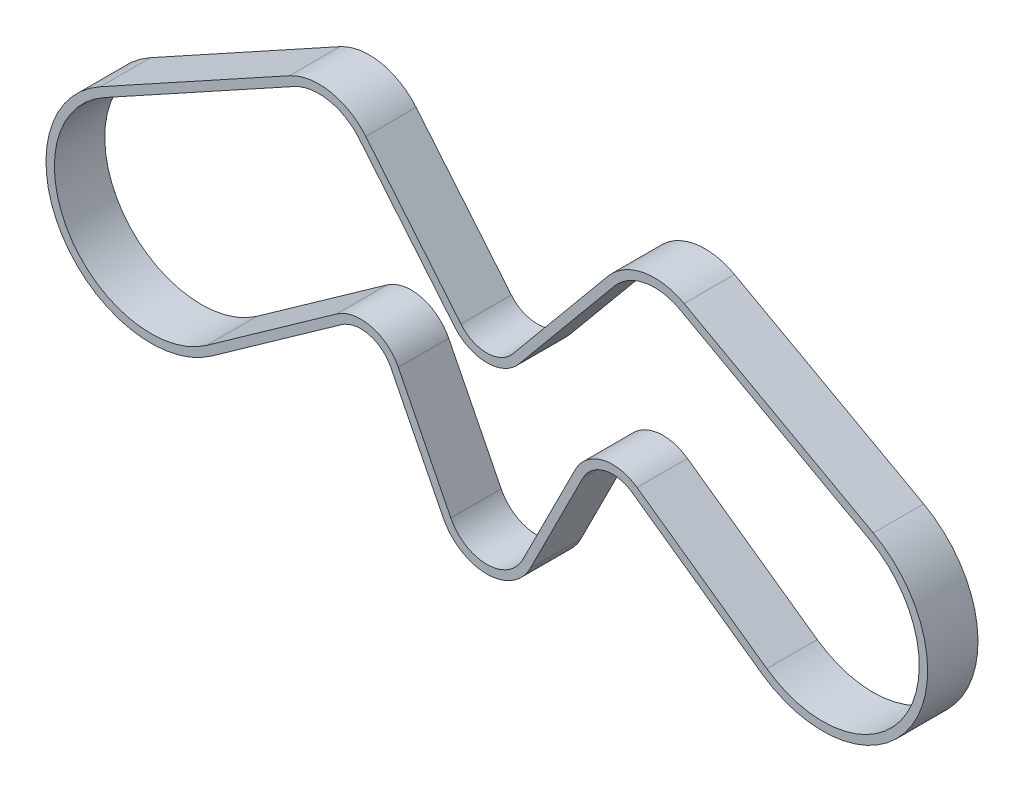
ISO-10303-21;
HEADER;
FILE_DESCRIPTION(('STEP AP214'),'2;1');
FILE_NAME('part.step','',(''),(''),'','','');
FILE_SCHEMA(('AUTOMOTIVE_DESIGN { 1 0 10303 214 1 1 1 1 }'));
ENDSEC;
DATA;
#1=APPLICATION_CONTEXT('core data for automotive mechanical design processes');
#2=APPLICATION_PROTOCOL_DEFINITION('international standard','automotive_design',2000,#1);
#3=PRODUCT_CONTEXT('',#1,'mechanical');
#4=PRODUCT('Part','Part','',(#3));
#5=PRODUCT_RELATED_PRODUCT_CATEGORY('part','',(#4));
#6=PRODUCT_DEFINITION_FORMATION('','',#4);
#7=PRODUCT_DEFINITION_CONTEXT('part definition',#1,'design');
#8=PRODUCT_DEFINITION('design','',#6,#7);
#9=PRODUCT_DEFINITION_SHAPE('','',#8);
#10=(LENGTH_UNIT() NAMED_UNIT(*) SI_UNIT(.MILLI.,.METRE.));
#11=(NAMED_UNIT(*) PLANE_ANGLE_UNIT() SI_UNIT($,.RADIAN.));
#12=(NAMED_UNIT(*) SI_UNIT($,.STERADIAN.) SOLID_ANGLE_UNIT());
#13=UNCERTAINTY_MEASURE_WITH_UNIT(LENGTH_MEASURE(1.E-05),#10,'distance_accuracy_value','');
#14=(GEOMETRIC_REPRESENTATION_CONTEXT(3) GLOBAL_UNCERTAINTY_ASSIGNED_CONTEXT((#13)) GLOBAL_UNIT_ASSIGNED_CONTEXT((#10,
#11,#12)) REPRESENTATION_CONTEXT('',''));
#15=CARTESIAN_POINT('',(0.,0.,0.));
#16=DIRECTION('',(0.,0.,1.));
#17=DIRECTION('',(1.,0.,0.));
#18=AXIS2_PLACEMENT_3D('',#15,#16,#17);
#19=CARTESIAN_POINT('',(23.4058260195633,11.784615689278,6.));
#20=DIRECTION('',(-0.893176589158385,-0.449706104672143,0.));
#21=DIRECTION('',(0.449706104672143,-0.893176589158386,0.));
#22=AXIS2_PLACEMENT_3D('',#19,#20,#21);
#23=PLANE('',#22);
#24=DIRECTION('',(-0.449706104672143,0.893176589158386,0.));
#25=VECTOR('',#24,1.);
#26=CARTESIAN_POINT('',(23.4058260195633,11.784615689278,0.));
#27=LINE('',#26,#25);
#28=CARTESIAN_POINT('',(35.7127523720349,-12.6585893024307,0.));
#29=VERTEX_POINT('',#28);
#30=CARTESIAN_POINT('',(29.4658829457859,-0.251469476644339,0.));
#31=VERTEX_POINT('',#30);
#32=EDGE_CURVE('E327',#29,#31,#27,.T.);
#33=ORIENTED_EDGE('',*,*,#32,.T.);
#34=DIRECTION('',(0.,0.,-1.));
#35=VECTOR('',#34,1.);
#36=CARTESIAN_POINT('',(29.4658829457859,-0.251469476644339,6.));
#37=LINE('',#36,#35);
#38=CARTESIAN_POINT('',(29.4658829457859,-0.251469476644339,6.));
#39=VERTEX_POINT('',#38);
#40=EDGE_CURVE('E11',#39,#31,#37,.T.);
#41=ORIENTED_EDGE('',*,*,#40,.F.);
#42=DIRECTION('',(-0.449706104672143,0.893176589158386,0.));
#43=VECTOR('',#42,1.);
#44=CARTESIAN_POINT('',(23.4058260195633,11.784615689278,6.));
#45=LINE('',#44,#43);
#46=CARTESIAN_POINT('',(35.7127523720349,-12.6585893024307,6.));
#47=VERTEX_POINT('',#46);
#48=EDGE_CURVE('E485',#47,#39,#45,.T.);
#49=ORIENTED_EDGE('',*,*,#48,.F.);
#50=DIRECTION('',(0.,0.,-1.));
#51=VECTOR('',#50,1.);
#52=CARTESIAN_POINT('',(35.7127523720349,-12.6585893024307,6.));
#53=LINE('',#52,#51);
#54=EDGE_CURVE('E358',#47,#29,#53,.T.);
#55=ORIENTED_EDGE('',*,*,#54,.T.);
#56=EDGE_LOOP('',(#33,#41,#49,#55));
#57=FACE_BOUND('',#56,.T.);
#58=ADVANCED_FACE('F35',(#57),#23,.F.);
#59=CARTESIAN_POINT('',(24.9999999999939,-2.50000000000506,6.));
#60=DIRECTION('',(0.,0.,-1.));
#61=DIRECTION('',(-1.,0.,0.));
#62=AXIS2_PLACEMENT_3D('',#59,#60,#61);
#63=CYLINDRICAL_SURFACE('',#62,5.);
#64=CARTESIAN_POINT('',(24.9999999999939,-2.50000000000506,0.));
#65=DIRECTION('',(0.,0.,1.));
#66=DIRECTION('',(1.,0.,0.));
#67=AXIS2_PLACEMENT_3D('',#64,#65,#66);
#68=CIRCLE('',#67,5.);
#69=CARTESIAN_POINT('',(22.1078672340831,1.57867234088542,0.));
#70=VERTEX_POINT('',#69);
#71=EDGE_CURVE('E330',#31,#70,#68,.T.);
#72=ORIENTED_EDGE('',*,*,#71,.T.);
#73=DIRECTION('',(0.,0.,-1.));
#74=VECTOR('',#73,1.);
#75=CARTESIAN_POINT('',(22.1078672340831,1.57867234088542,6.));
#76=LINE('',#75,#74);
#77=CARTESIAN_POINT('',(22.1078672340831,1.57867234088542,6.));
#78=VERTEX_POINT('',#77);
#79=EDGE_CURVE('E45',#78,#70,#76,.T.);
#80=ORIENTED_EDGE('',*,*,#79,.F.);
#81=CARTESIAN_POINT('',(24.9999999999939,-2.50000000000506,6.));
#82=DIRECTION('',(0.,0.,1.));
#83=DIRECTION('',(1.,0.,0.));
#84=AXIS2_PLACEMENT_3D('',#81,#82,#83);
#85=CIRCLE('',#84,5.);
#86=EDGE_CURVE('E487',#39,#78,#85,.T.);
#87=ORIENTED_EDGE('',*,*,#86,.F.);
#88=ORIENTED_EDGE('',*,*,#40,.T.);
#89=EDGE_LOOP('',(#72,#80,#87,#88));
#90=FACE_BOUND('',#89,.T.);
#91=ADVANCED_FACE('F538',(#90),#63,.T.);
#92=CARTESIAN_POINT('',(6.65190536159491,-9.38094638404809,6.));
#93=DIRECTION('',(0.578426553182166,-0.815734468178094,0.));
#94=DIRECTION('',(0.815734468178095,0.578426553182166,0.));
#95=AXIS2_PLACEMENT_3D('',#92,#93,#94);
#96=PLANE('',#95);
#97=DIRECTION('',(-0.815734468178095,-0.578426553182166,0.));
#98=VECTOR('',#97,1.);
#99=CARTESIAN_POINT('',(6.65190536159491,-9.38094638404809,0.));
#100=LINE('',#99,#98);
#101=CARTESIAN_POINT('',(6.65190536159491,-9.38094638404809,0.));
#102=VERTEX_POINT('',#101);
#103=EDGE_CURVE('E332',#70,#102,#100,.T.);
#104=ORIENTED_EDGE('',*,*,#103,.T.);
#105=DIRECTION('',(0.,0.,-1.));
#106=VECTOR('',#105,1.);
#107=CARTESIAN_POINT('',(6.65190536159491,-9.38094638404809,6.));
#108=LINE('',#107,#106);
#109=CARTESIAN_POINT('',(6.65190536159491,-9.38094638404809,6.));
#110=VERTEX_POINT('',#109);
#111=EDGE_CURVE('E389',#110,#102,#108,.T.);
#112=ORIENTED_EDGE('',*,*,#111,.F.);
#113=DIRECTION('',(-0.815734468178095,-0.578426553182166,0.));
#114=VECTOR('',#113,1.);
#115=CARTESIAN_POINT('',(6.65190536159491,-9.38094638404809,6.));
#116=LINE('',#115,#114);
#117=EDGE_CURVE('E489',#78,#110,#116,.T.);
#118=ORIENTED_EDGE('',*,*,#117,.F.);
#119=ORIENTED_EDGE('',*,*,#79,.T.);
#120=EDGE_LOOP('',(#104,#112,#118,#119));
#121=FACE_BOUND('',#120,.T.);
#122=ADVANCED_FACE('F543',(#121),#96,.F.);
#123=CARTESIAN_POINT('',(0.,0.,6.));
#124=DIRECTION('',(0.,0.,-1.));
#125=DIRECTION('',(-1.,0.,0.));
#126=AXIS2_PLACEMENT_3D('',#123,#124,#125);
#127=CYLINDRICAL_SURFACE('',#126,11.5);
#128=CARTESIAN_POINT('',(0.,0.,0.));
#129=DIRECTION('',(0.,0.,1.));
#130=DIRECTION('',(1.,0.,0.));
#131=AXIS2_PLACEMENT_3D('',#128,#129,#130);
#132=CIRCLE('',#131,11.5);
#133=CARTESIAN_POINT('',(-5.54492384116576,10.0749104013719,0.));
#134=VERTEX_POINT('',#133);
#135=EDGE_CURVE('E334',#102,#134,#132,.F.);
#136=ORIENTED_EDGE('',*,*,#135,.T.);
#137=DIRECTION('',(0.,0.,-1.));
#138=VECTOR('',#137,1.);
#139=CARTESIAN_POINT('',(-5.54492384116576,10.0749104013719,6.));
#140=LINE('',#139,#138);
#141=CARTESIAN_POINT('',(-5.54492384116576,10.0749104013719,6.));
#142=VERTEX_POINT('',#141);
#143=EDGE_CURVE('E386',#142,#134,#140,.T.);
#144=ORIENTED_EDGE('',*,*,#143,.F.);
#145=CARTESIAN_POINT('',(0.,0.,6.));
#146=DIRECTION('',(0.,0.,1.));
#147=DIRECTION('',(1.,0.,0.));
#148=AXIS2_PLACEMENT_3D('',#145,#146,#147);
#149=CIRCLE('',#148,11.5);
#150=EDGE_CURVE('E491',#110,#142,#149,.F.);
#151=ORIENTED_EDGE('',*,*,#150,.F.);
#152=ORIENTED_EDGE('',*,*,#111,.T.);
#153=EDGE_LOOP('',(#136,#144,#151,#152));
#154=FACE_BOUND('',#153,.T.);
#155=ADVANCED_FACE('F637',(#154),#127,.F.);
#156=CARTESIAN_POINT('',(-5.54492384116576,10.0749104013719,6.));
#157=DIRECTION('',(-0.482167290536153,0.876079165336686,0.));
#158=DIRECTION('',(-0.876079165336686,-0.482167290536153,0.));
#159=AXIS2_PLACEMENT_3D('',#156,#157,#158);
#160=PLANE('',#159);
#161=DIRECTION('',(0.876079165336686,0.482167290536153,0.));
#162=VECTOR('',#161,1.);
#163=CARTESIAN_POINT('',(-5.54492384116576,10.0749104013719,0.));
#164=LINE('',#163,#162);
#165=CARTESIAN_POINT('',(16.9864544341424,22.4754947833499,0.));
#166=VERTEX_POINT('',#165);
#167=EDGE_CURVE('E336',#134,#166,#164,.T.);
#168=ORIENTED_EDGE('',*,*,#167,.T.);
#169=DIRECTION('',(0.,0.,-1.));
#170=VECTOR('',#169,1.);
#171=CARTESIAN_POINT('',(16.9864544341424,22.4754947833499,6.));
#172=LINE('',#171,#170);
#173=CARTESIAN_POINT('',(16.9864544341424,22.4754947833499,6.));
#174=VERTEX_POINT('',#173);
#175=EDGE_CURVE('E383',#174,#166,#172,.T.);
#176=ORIENTED_EDGE('',*,*,#175,.F.);
#177=DIRECTION('',(0.876079165336686,0.482167290536153,0.));
#178=VECTOR('',#177,1.);
#179=CARTESIAN_POINT('',(-5.54492384116576,10.0749104013719,6.));
#180=LINE('',#179,#178);
#181=EDGE_CURVE('E493',#142,#174,#180,.T.);
#182=ORIENTED_EDGE('',*,*,#181,.F.);
#183=ORIENTED_EDGE('',*,*,#143,.T.);
#184=EDGE_LOOP('',(#168,#176,#182,#183));
#185=FACE_BOUND('',#184,.T.);
#186=ADVANCED_FACE('F633',(#185),#160,.F.);
#187=CARTESIAN_POINT('',(19.9999999999933,16.9999999999957,6.));
#188=DIRECTION('',(0.,0.,-1.));
#189=DIRECTION('',(-1.,0.,0.));
#190=AXIS2_PLACEMENT_3D('',#187,#188,#189);
#191=CYLINDRICAL_SURFACE('',#190,6.25);
#192=CARTESIAN_POINT('',(19.9999999999933,16.9999999999957,0.));
#193=DIRECTION('',(0.,0.,1.));
#194=DIRECTION('',(1.,0.,0.));
#195=AXIS2_PLACEMENT_3D('',#192,#193,#194);
#196=CIRCLE('',#195,6.25);
#197=CARTESIAN_POINT('',(24.8118906150726,20.9885095848546,0.));
#198=VERTEX_POINT('',#197);
#199=EDGE_CURVE('E338',#166,#198,#196,.F.);
#200=ORIENTED_EDGE('',*,*,#199,.T.);
#201=DIRECTION('',(0.,0.,-1.));
#202=VECTOR('',#201,1.);
#203=CARTESIAN_POINT('',(24.8118906150726,20.9885095848546,6.));
#204=LINE('',#203,#202);
#205=CARTESIAN_POINT('',(24.8118906150726,20.9885095848546,6.));
#206=VERTEX_POINT('',#205);
#207=EDGE_CURVE('E380',#206,#198,#204,.T.);
#208=ORIENTED_EDGE('',*,*,#207,.F.);
#209=CARTESIAN_POINT('',(19.9999999999933,16.9999999999957,6.));
#210=DIRECTION('',(0.,0.,1.));
#211=DIRECTION('',(1.,0.,0.));
#212=AXIS2_PLACEMENT_3D('',#209,#210,#211);
#213=CIRCLE('',#212,6.25);
#214=EDGE_CURVE('E495',#174,#206,#213,.F.);
#215=ORIENTED_EDGE('',*,*,#214,.F.);
#216=ORIENTED_EDGE('',*,*,#175,.T.);
#217=EDGE_LOOP('',(#200,#208,#215,#216));
#218=FACE_BOUND('',#217,.T.);
#219=ADVANCED_FACE('F629',(#218),#191,.F.);
#220=CARTESIAN_POINT('',(25.0193644608815,20.738205196641,6.));
#221=DIRECTION('',(0.769902498412688,0.638161533577433,0.));
#222=DIRECTION('',(-0.638161533577433,0.769902498412688,0.));
#223=AXIS2_PLACEMENT_3D('',#220,#221,#222);
#224=PLANE('',#223);
#225=DIRECTION('',(0.638161533577433,-0.769902498412688,0.));
#226=VECTOR('',#225,1.);
#227=CARTESIAN_POINT('',(25.0193644608815,20.738205196641,0.));
#228=LINE('',#227,#226);
#229=CARTESIAN_POINT('',(36.1504875079299,7.30919233210783,0.));
#230=VERTEX_POINT('',#229);
#231=EDGE_CURVE('E340',#198,#230,#228,.T.);
#232=ORIENTED_EDGE('',*,*,#231,.T.);
#233=DIRECTION('',(0.,0.,-1.));
#234=VECTOR('',#233,1.);
#235=CARTESIAN_POINT('',(36.1504875079299,7.30919233210783,6.));
#236=LINE('',#235,#234);
#237=CARTESIAN_POINT('',(36.1504875079299,7.30919233210783,6.));
#238=VERTEX_POINT('',#237);
#239=EDGE_CURVE('E377',#238,#230,#236,.T.);
#240=ORIENTED_EDGE('',*,*,#239,.F.);
#241=DIRECTION('',(0.638161533577433,-0.769902498412688,0.));
#242=VECTOR('',#241,1.);
#243=CARTESIAN_POINT('',(25.0193644608815,20.738205196641,6.));
#244=LINE('',#243,#242);
#245=EDGE_CURVE('E497',#206,#238,#244,.T.);
#246=ORIENTED_EDGE('',*,*,#245,.F.);
#247=ORIENTED_EDGE('',*,*,#207,.T.);
#248=EDGE_LOOP('',(#232,#240,#246,#247));
#249=FACE_BOUND('',#248,.T.);
#250=ADVANCED_FACE('F625',(#249),#224,.F.);
#251=CARTESIAN_POINT('',(39.9999999999933,10.499999999995,6.));
#252=DIRECTION('',(0.,0.,-1.));
#253=DIRECTION('',(-1.,0.,0.));
#254=AXIS2_PLACEMENT_3D('',#251,#252,#253);
#255=CYLINDRICAL_SURFACE('',#254,5.);
#256=CARTESIAN_POINT('',(39.9999999999933,10.499999999995,0.));
#257=DIRECTION('',(0.,0.,1.));
#258=DIRECTION('',(1.,0.,0.));
#259=AXIS2_PLACEMENT_3D('',#256,#257,#258);
#260=CIRCLE('',#259,5.);
#261=CARTESIAN_POINT('',(43.8495124920567,7.30919233210781,0.));
#262=VERTEX_POINT('',#261);
#263=EDGE_CURVE('E342',#230,#262,#260,.T.);
#264=ORIENTED_EDGE('',*,*,#263,.T.);
#265=DIRECTION('',(0.,0.,-1.));
#266=VECTOR('',#265,1.);
#267=CARTESIAN_POINT('',(43.8495124920567,7.30919233210781,6.));
#268=LINE('',#267,#266);
#269=CARTESIAN_POINT('',(43.8495124920567,7.30919233210781,6.));
#270=VERTEX_POINT('',#269);
#271=EDGE_CURVE('E374',#270,#262,#268,.T.);
#272=ORIENTED_EDGE('',*,*,#271,.F.);
#273=CARTESIAN_POINT('',(39.9999999999933,10.499999999995,6.));
#274=DIRECTION('',(0.,0.,1.));
#275=DIRECTION('',(1.,0.,0.));
#276=AXIS2_PLACEMENT_3D('',#273,#274,#275);
#277=CIRCLE('',#276,5.);
#278=EDGE_CURVE('E499',#238,#270,#277,.T.);
#279=ORIENTED_EDGE('',*,*,#278,.F.);
#280=ORIENTED_EDGE('',*,*,#239,.T.);
#281=EDGE_LOOP('',(#264,#272,#279,#280));
#282=FACE_BOUND('',#281,.T.);
#283=ADVANCED_FACE('F621',(#282),#255,.T.);
#284=CARTESIAN_POINT('',(22.4006241040783,-18.5675675307235,6.));
#285=DIRECTION('',(-0.769902498412685,0.638161533577436,0.));
#286=DIRECTION('',(-0.638161533577436,-0.769902498412685,0.));
#287=AXIS2_PLACEMENT_3D('',#284,#285,#286);
#288=PLANE('',#287);
#289=DIRECTION('',(0.638161533577436,0.769902498412685,0.));
#290=VECTOR('',#289,1.);
#291=CARTESIAN_POINT('',(22.4006241040783,-18.5675675307235,0.));
#292=LINE('',#291,#290);
#293=CARTESIAN_POINT('',(55.1881093849141,20.9885095848546,0.));
#294=VERTEX_POINT('',#293);
#295=EDGE_CURVE('E344',#262,#294,#292,.T.);
#296=ORIENTED_EDGE('',*,*,#295,.T.);
#297=DIRECTION('',(0.,0.,-1.));
#298=VECTOR('',#297,1.);
#299=CARTESIAN_POINT('',(55.1881093849141,20.9885095848546,6.));
#300=LINE('',#299,#298);
#301=CARTESIAN_POINT('',(55.1881093849141,20.9885095848546,6.));
#302=VERTEX_POINT('',#301);
#303=EDGE_CURVE('E371',#302,#294,#300,.T.);
#304=ORIENTED_EDGE('',*,*,#303,.F.);
#305=DIRECTION('',(0.638161533577436,0.769902498412685,0.));
#306=VECTOR('',#305,1.);
#307=CARTESIAN_POINT('',(22.4006241040783,-18.5675675307235,6.));
#308=LINE('',#307,#306);
#309=EDGE_CURVE('E501',#270,#302,#308,.T.);
#310=ORIENTED_EDGE('',*,*,#309,.F.);
#311=ORIENTED_EDGE('',*,*,#271,.T.);
#312=EDGE_LOOP('',(#296,#304,#310,#311));
#313=FACE_BOUND('',#312,.T.);
#314=ADVANCED_FACE('F617',(#313),#288,.F.);
#315=CARTESIAN_POINT('',(59.9999999999933,16.9999999999956,6.));
#316=DIRECTION('',(0.,0.,-1.));
#317=DIRECTION('',(-1.,0.,0.));
#318=AXIS2_PLACEMENT_3D('',#315,#316,#317);
#319=CYLINDRICAL_SURFACE('',#318,6.25);
#320=CARTESIAN_POINT('',(59.9999999999933,16.9999999999956,0.));
#321=DIRECTION('',(0.,0.,1.));
#322=DIRECTION('',(1.,0.,0.));
#323=AXIS2_PLACEMENT_3D('',#320,#321,#322);
#324=CIRCLE('',#323,6.25);
#325=CARTESIAN_POINT('',(63.0135455658397,22.4754947833525,0.));
#326=VERTEX_POINT('',#325);
#327=EDGE_CURVE('E346',#294,#326,#324,.F.);
#328=ORIENTED_EDGE('',*,*,#327,.T.);
#329=DIRECTION('',(0.,0.,-1.));
#330=VECTOR('',#329,1.);
#331=CARTESIAN_POINT('',(63.0135455658397,22.4754947833525,6.));
#332=LINE('',#331,#330);
#333=CARTESIAN_POINT('',(63.0135455658397,22.4754947833525,6.));
#334=VERTEX_POINT('',#333);
#335=EDGE_CURVE('E368',#334,#326,#332,.T.);
#336=ORIENTED_EDGE('',*,*,#335,.F.);
#337=CARTESIAN_POINT('',(59.9999999999933,16.9999999999956,6.));
#338=DIRECTION('',(0.,0.,1.));
#339=DIRECTION('',(1.,0.,0.));
#340=AXIS2_PLACEMENT_3D('',#337,#338,#339);
#341=CIRCLE('',#340,6.25);
#342=EDGE_CURVE('E503',#302,#334,#341,.F.);
#343=ORIENTED_EDGE('',*,*,#342,.F.);
#344=ORIENTED_EDGE('',*,*,#303,.T.);
#345=EDGE_LOOP('',(#328,#336,#343,#344));
#346=FACE_BOUND('',#345,.T.);
#347=ADVANCED_FACE('F613',(#346),#319,.F.);
#348=CARTESIAN_POINT('',(24.1437475261455,43.868247796999,6.));
#349=DIRECTION('',(0.482167290535413,0.876079165337094,0.));
#350=DIRECTION('',(-0.876079165337094,0.482167290535413,0.));
#351=AXIS2_PLACEMENT_3D('',#348,#349,#350);
#352=PLANE('',#351);
#353=DIRECTION('',(0.876079165337094,-0.482167290535413,0.));
#354=VECTOR('',#353,1.);
#355=CARTESIAN_POINT('',(24.1437475261455,43.868247796999,0.));
#356=LINE('',#355,#354);
#357=CARTESIAN_POINT('',(85.5449238412003,10.0749104013704,0.));
#358=VERTEX_POINT('',#357);
#359=EDGE_CURVE('E348',#326,#358,#356,.T.);
#360=ORIENTED_EDGE('',*,*,#359,.T.);
#361=DIRECTION('',(0.,0.,-1.));
#362=VECTOR('',#361,1.);
#363=CARTESIAN_POINT('',(85.5449238412003,10.0749104013704,6.));
#364=LINE('',#363,#362);
#365=CARTESIAN_POINT('',(85.5449238412003,10.0749104013704,6.));
#366=VERTEX_POINT('',#365);
#367=EDGE_CURVE('E365',#366,#358,#364,.T.);
#368=ORIENTED_EDGE('',*,*,#367,.F.);
#369=DIRECTION('',(0.876079165337094,-0.482167290535413,0.));
#370=VECTOR('',#369,1.);
#371=CARTESIAN_POINT('',(24.1437475261455,43.868247796999,6.));
#372=LINE('',#371,#370);
#373=EDGE_CURVE('E505',#334,#366,#372,.T.);
#374=ORIENTED_EDGE('',*,*,#373,.F.);
#375=ORIENTED_EDGE('',*,*,#335,.T.);
#376=EDGE_LOOP('',(#360,#368,#374,#375));
#377=FACE_BOUND('',#376,.T.);
#378=ADVANCED_FACE('F610',(#377),#352,.F.);
#379=CARTESIAN_POINT('',(80.000000000043,-6.20857532052099E-12,6.));
#380=DIRECTION('',(0.,0.,-1.));
#381=DIRECTION('',(-1.,0.,0.));
#382=AXIS2_PLACEMENT_3D('',#379,#380,#381);
#383=CYLINDRICAL_SURFACE('',#382,11.5);
#384=CARTESIAN_POINT('',(80.000000000043,-6.20857532052099E-12,0.));
#385=DIRECTION('',(0.,0.,1.));
#386=DIRECTION('',(1.,0.,0.));
#387=AXIS2_PLACEMENT_3D('',#384,#385,#386);
#388=CIRCLE('',#387,11.5);
#389=CARTESIAN_POINT('',(73.3480946384614,-9.38094638406371,0.));
#390=VERTEX_POINT('',#389);
#391=EDGE_CURVE('E350',#358,#390,#388,.F.);
#392=ORIENTED_EDGE('',*,*,#391,.T.);
#393=DIRECTION('',(0.,0.,-1.));
#394=VECTOR('',#393,1.);
#395=CARTESIAN_POINT('',(73.3480946384614,-9.38094638406371,6.));
#396=LINE('',#395,#394);
#397=CARTESIAN_POINT('',(73.3480946384614,-9.38094638406371,6.));
#398=VERTEX_POINT('',#397);
#399=EDGE_CURVE('E362',#398,#390,#396,.T.);
#400=ORIENTED_EDGE('',*,*,#399,.F.);
#401=CARTESIAN_POINT('',(80.000000000043,-6.20857532052099E-12,6.));
#402=DIRECTION('',(0.,0.,1.));
#403=DIRECTION('',(1.,0.,0.));
#404=AXIS2_PLACEMENT_3D('',#401,#402,#403);
#405=CIRCLE('',#404,11.5);
#406=EDGE_CURVE('E507',#366,#398,#405,.F.);
#407=ORIENTED_EDGE('',*,*,#406,.F.);
#408=ORIENTED_EDGE('',*,*,#367,.T.);
#409=EDGE_LOOP('',(#392,#400,#407,#408));
#410=FACE_BOUND('',#409,.T.);
#411=ADVANCED_FACE('F513',(#410),#383,.F.);
#412=CARTESIAN_POINT('',(20.1142768324191,28.3664517551326,6.));
#413=DIRECTION('',(-0.578426553181012,-0.815734468178913,0.));
#414=DIRECTION('',(0.815734468178913,-0.578426553181012,0.));
#415=AXIS2_PLACEMENT_3D('',#412,#413,#414);
#416=PLANE('',#415);
#417=DIRECTION('',(-0.815734468178913,0.578426553181012,0.));
#418=VECTOR('',#417,1.);
#419=CARTESIAN_POINT('',(20.1142768324191,28.3664517551326,0.));
#420=LINE('',#419,#418);
#421=CARTESIAN_POINT('',(57.892132765899,1.57867234088956,0.));
#422=VERTEX_POINT('',#421);
#423=EDGE_CURVE('E352',#390,#422,#420,.T.);
#424=ORIENTED_EDGE('',*,*,#423,.T.);
#425=DIRECTION('',(0.,0.,-1.));
#426=VECTOR('',#425,1.);
#427=CARTESIAN_POINT('',(57.892132765899,1.57867234088956,6.));
#428=LINE('',#427,#426);
#429=CARTESIAN_POINT('',(57.892132765899,1.57867234088956,6.));
#430=VERTEX_POINT('',#429);
#431=EDGE_CURVE('E270',#430,#422,#428,.T.);
#432=ORIENTED_EDGE('',*,*,#431,.F.);
#433=DIRECTION('',(-0.815734468178913,0.578426553181012,0.));
#434=VECTOR('',#433,1.);
#435=CARTESIAN_POINT('',(20.1142768324191,28.3664517551326,6.));
#436=LINE('',#435,#434);
#437=EDGE_CURVE('E261',#398,#430,#436,.T.);
#438=ORIENTED_EDGE('',*,*,#437,.F.);
#439=ORIENTED_EDGE('',*,*,#399,.T.);
#440=EDGE_LOOP('',(#424,#432,#438,#439));
#441=FACE_BOUND('',#440,.T.);
#442=ADVANCED_FACE('F517',(#441),#416,.F.);
#443=CARTESIAN_POINT('',(54.9999999999939,-2.500000000005,6.));
#444=DIRECTION('',(0.,0.,-1.));
#445=DIRECTION('',(-1.,0.,0.));
#446=AXIS2_PLACEMENT_3D('',#443,#444,#445);
#447=CYLINDRICAL_SURFACE('',#446,5.);
#448=CARTESIAN_POINT('',(54.9999999999939,-2.500000000005,0.));
#449=DIRECTION('',(0.,0.,1.));
#450=DIRECTION('',(1.,0.,0.));
#451=AXIS2_PLACEMENT_3D('',#448,#449,#450);
#452=CIRCLE('',#451,5.);
#453=CARTESIAN_POINT('',(50.5341170542016,-0.251469476644988,0.));
#454=VERTEX_POINT('',#453);
#455=EDGE_CURVE('E269',#422,#454,#452,.T.);
#456=ORIENTED_EDGE('',*,*,#455,.T.);
#457=DIRECTION('',(0.,0.,-1.));
#458=VECTOR('',#457,1.);
#459=CARTESIAN_POINT('',(50.5341170542016,-0.251469476644988,6.));
#460=LINE('',#459,#458);
#461=CARTESIAN_POINT('',(50.5341170542016,-0.251469476644988,6.));
#462=VERTEX_POINT('',#461);
#463=EDGE_CURVE('E266',#462,#454,#460,.T.);
#464=ORIENTED_EDGE('',*,*,#463,.F.);
#465=CARTESIAN_POINT('',(54.9999999999939,-2.500000000005,6.));
#466=DIRECTION('',(0.,0.,1.));
#467=DIRECTION('',(1.,0.,0.));
#468=AXIS2_PLACEMENT_3D('',#465,#466,#467);
#469=CIRCLE('',#468,5.);
#470=EDGE_CURVE('E255',#430,#462,#469,.T.);
#471=ORIENTED_EDGE('',*,*,#470,.F.);
#472=ORIENTED_EDGE('',*,*,#431,.T.);
#473=EDGE_LOOP('',(#456,#464,#471,#472));
#474=FACE_BOUND('',#473,.T.);
#475=ADVANCED_FACE('F267',(#474),#447,.T.);
#476=CARTESIAN_POINT('',(40.4153275340819,-20.3487414862938,6.));
#477=DIRECTION('',(0.893176589158456,-0.449706104672003,0.));
#478=DIRECTION('',(0.449706104672003,0.893176589158456,0.));
#479=AXIS2_PLACEMENT_3D('',#476,#477,#478);
#480=PLANE('',#479);
#481=DIRECTION('',(-0.449706104672003,-0.893176589158456,0.));
#482=VECTOR('',#481,1.);
#483=CARTESIAN_POINT('',(40.4153275340819,-20.3487414862938,0.));
#484=LINE('',#483,#482);
#485=CARTESIAN_POINT('',(44.2872476279557,-12.65858930243,0.));
#486=VERTEX_POINT('',#485);
#487=EDGE_CURVE('E155',#454,#486,#484,.T.);
#488=ORIENTED_EDGE('',*,*,#487,.T.);
#489=DIRECTION('',(0.,0.,-1.));
#490=VECTOR('',#489,1.);
#491=CARTESIAN_POINT('',(44.2872476279557,-12.65858930243,6.));
#492=LINE('',#491,#490);
#493=CARTESIAN_POINT('',(44.2872476279557,-12.65858930243,6.));
#494=VERTEX_POINT('',#493);
#495=EDGE_CURVE('E271',#494,#486,#492,.T.);
#496=ORIENTED_EDGE('',*,*,#495,.F.);
#497=DIRECTION('',(-0.449706104672003,-0.893176589158456,0.));
#498=VECTOR('',#497,1.);
#499=CARTESIAN_POINT('',(40.4153275340819,-20.3487414862938,6.));
#500=LINE('',#499,#498);
#501=EDGE_CURVE('E259',#462,#494,#500,.T.);
#502=ORIENTED_EDGE('',*,*,#501,.F.);
#503=ORIENTED_EDGE('',*,*,#463,.T.);
#504=EDGE_LOOP('',(#488,#496,#502,#503));
#505=FACE_BOUND('',#504,.T.);
#506=ADVANCED_FACE('F273',(#505),#480,.F.);
#507=CARTESIAN_POINT('',(0.,0.,6.));
#508=DIRECTION('',(0.,0.,-1.));
#509=DIRECTION('',(-1.,0.,0.));
#510=AXIS2_PLACEMENT_3D('',#507,#508,#509);
#511=CYLINDRICAL_SURFACE('',#510,12.5);
#512=CARTESIAN_POINT('',(0.,0.,0.));
#513=DIRECTION('',(0.,0.,1.));
#514=DIRECTION('',(1.,0.,0.));
#515=AXIS2_PLACEMENT_3D('',#512,#513,#514);
#516=CIRCLE('',#515,12.5);
#517=CARTESIAN_POINT('',(7.23033191477708,-10.1966808522262,0.));
#518=VERTEX_POINT('',#517);
#519=CARTESIAN_POINT('',(-6.02709113170192,10.9509895667086,0.));
#520=VERTEX_POINT('',#519);
#521=EDGE_CURVE('E279',#518,#520,#516,.F.);
#522=ORIENTED_EDGE('',*,*,#521,.F.);
#523=DIRECTION('',(0.,0.,-1.));
#524=VECTOR('',#523,1.);
#525=CARTESIAN_POINT('',(7.23033191477708,-10.1966808522262,6.));
#526=LINE('',#525,#524);
#527=CARTESIAN_POINT('',(7.23033191477708,-10.1966808522262,6.));
#528=VERTEX_POINT('',#527);
#529=EDGE_CURVE('E39',#528,#518,#526,.T.);
#530=ORIENTED_EDGE('',*,*,#529,.F.);
#531=CARTESIAN_POINT('',(0.,0.,6.));
#532=DIRECTION('',(0.,0.,1.));
#533=DIRECTION('',(1.,0.,0.));
#534=AXIS2_PLACEMENT_3D('',#531,#532,#533);
#535=CIRCLE('',#534,12.5);
#536=CARTESIAN_POINT('',(-6.02709113170192,10.9509895667086,6.));
#537=VERTEX_POINT('',#536);
#538=EDGE_CURVE('E357',#528,#537,#535,.F.);
#539=ORIENTED_EDGE('',*,*,#538,.T.);
#540=DIRECTION('',(0.,0.,-1.));
#541=VECTOR('',#540,1.);
#542=CARTESIAN_POINT('',(-6.02709113170192,10.9509895667086,6.));
#543=LINE('',#542,#541);
#544=EDGE_CURVE('E275',#537,#520,#543,.T.);
#545=ORIENTED_EDGE('',*,*,#544,.T.);
#546=EDGE_LOOP('',(#522,#530,#539,#545));
#547=FACE_BOUND('',#546,.T.);
#548=ADVANCED_FACE('F37',(#547),#511,.T.);
#549=CARTESIAN_POINT('',(7.23033191477708,-10.1966808522262,6.));
#550=DIRECTION('',(0.578426553182166,-0.815734468178094,0.));
#551=DIRECTION('',(0.815734468178095,0.578426553182166,0.));
#552=AXIS2_PLACEMENT_3D('',#549,#550,#551);
#553=PLANE('',#552);
#554=DIRECTION('',(-0.815734468178095,-0.578426553182166,0.));
#555=VECTOR('',#554,1.);
#556=CARTESIAN_POINT('',(7.23033191477708,-10.1966808522262,0.));
#557=LINE('',#556,#555);
#558=CARTESIAN_POINT('',(22.6862937872653,0.762937872707323,0.));
#559=VERTEX_POINT('',#558);
#560=EDGE_CURVE('E282',#559,#518,#557,.T.);
#561=ORIENTED_EDGE('',*,*,#560,.F.);
#562=DIRECTION('',(0.,0.,-1.));
#563=VECTOR('',#562,1.);
#564=CARTESIAN_POINT('',(22.6862937872653,0.762937872707323,6.));
#565=LINE('',#564,#563);
#566=CARTESIAN_POINT('',(22.6862937872653,0.762937872707323,6.));
#567=VERTEX_POINT('',#566);
#568=EDGE_CURVE('E420',#567,#559,#565,.T.);
#569=ORIENTED_EDGE('',*,*,#568,.F.);
#570=DIRECTION('',(-0.815734468178095,-0.578426553182166,0.));
#571=VECTOR('',#570,1.);
#572=CARTESIAN_POINT('',(7.23033191477708,-10.1966808522262,6.));
#573=LINE('',#572,#571);
#574=EDGE_CURVE('E429',#567,#528,#573,.T.);
#575=ORIENTED_EDGE('',*,*,#574,.T.);
#576=ORIENTED_EDGE('',*,*,#529,.T.);
#577=EDGE_LOOP('',(#561,#569,#575,#576));
#578=FACE_BOUND('',#577,.T.);
#579=ADVANCED_FACE('F427',(#578),#553,.T.);
#580=CARTESIAN_POINT('',(24.9999999999939,-2.50000000000506,6.));
#581=DIRECTION('',(0.,0.,-1.));
#582=DIRECTION('',(-1.,0.,0.));
#583=AXIS2_PLACEMENT_3D('',#580,#581,#582);
#584=CYLINDRICAL_SURFACE('',#583,4.);
#585=CARTESIAN_POINT('',(24.9999999999939,-2.50000000000506,0.));
#586=DIRECTION('',(0.,0.,1.));
#587=DIRECTION('',(1.,0.,0.));
#588=AXIS2_PLACEMENT_3D('',#585,#586,#587);
#589=CIRCLE('',#588,4.);
#590=CARTESIAN_POINT('',(28.5727063566275,-0.701175581316479,0.));
#591=VERTEX_POINT('',#590);
#592=EDGE_CURVE('E285',#591,#559,#589,.T.);
#593=ORIENTED_EDGE('',*,*,#592,.F.);
#594=DIRECTION('',(0.,0.,-1.));
#595=VECTOR('',#594,1.);
#596=CARTESIAN_POINT('',(28.5727063566275,-0.701175581316479,6.));
#597=LINE('',#596,#595);
#598=CARTESIAN_POINT('',(28.5727063566275,-0.701175581316479,6.));
#599=VERTEX_POINT('',#598);
#600=EDGE_CURVE('E419',#599,#591,#597,.T.);
#601=ORIENTED_EDGE('',*,*,#600,.F.);
#602=CARTESIAN_POINT('',(24.9999999999939,-2.50000000000506,6.));
#603=DIRECTION('',(0.,0.,1.));
#604=DIRECTION('',(1.,0.,0.));
#605=AXIS2_PLACEMENT_3D('',#602,#603,#604);
#606=CIRCLE('',#605,4.);
#607=EDGE_CURVE('E437',#599,#567,#606,.T.);
#608=ORIENTED_EDGE('',*,*,#607,.T.);
#609=ORIENTED_EDGE('',*,*,#568,.T.);
#610=EDGE_LOOP('',(#593,#601,#608,#609));
#611=FACE_BOUND('',#610,.T.);
#612=ADVANCED_FACE('F435',(#611),#584,.F.);
#613=CARTESIAN_POINT('',(22.5126494304049,11.3349095846058,6.));
#614=DIRECTION('',(-0.893176589158386,-0.449706104672143,0.));
#615=DIRECTION('',(0.449706104672143,-0.893176589158386,0.));
#616=AXIS2_PLACEMENT_3D('',#613,#614,#615);
#617=PLANE('',#616);
#618=DIRECTION('',(-0.449706104672143,0.893176589158386,0.));
#619=VECTOR('',#618,1.);
#620=CARTESIAN_POINT('',(22.5126494304049,11.3349095846058,0.));
#621=LINE('',#620,#619);
#622=CARTESIAN_POINT('',(34.8195757828765,-13.1082954071028,0.));
#623=VERTEX_POINT('',#622);
#624=EDGE_CURVE('E288',#623,#591,#621,.T.);
#625=ORIENTED_EDGE('',*,*,#624,.F.);
#626=DIRECTION('',(0.,0.,-1.));
#627=VECTOR('',#626,1.);
#628=CARTESIAN_POINT('',(34.8195757828765,-13.1082954071028,6.));
#629=LINE('',#628,#627);
#630=CARTESIAN_POINT('',(34.8195757828765,-13.1082954071028,6.));
#631=VERTEX_POINT('',#630);
#632=EDGE_CURVE('E417',#631,#623,#629,.T.);
#633=ORIENTED_EDGE('',*,*,#632,.F.);
#634=DIRECTION('',(-0.449706104672143,0.893176589158386,0.));
#635=VECTOR('',#634,1.);
#636=CARTESIAN_POINT('',(22.5126494304049,11.3349095846058,6.));
#637=LINE('',#636,#635);
#638=EDGE_CURVE('E443',#631,#599,#637,.T.);
#639=ORIENTED_EDGE('',*,*,#638,.T.);
#640=ORIENTED_EDGE('',*,*,#600,.T.);
#641=EDGE_LOOP('',(#625,#633,#639,#640));
#642=FACE_BOUND('',#641,.T.);
#643=ADVANCED_FACE('F446',(#642),#617,.T.);
#644=CARTESIAN_POINT('',(39.9999999999951,-10.5000000000044,6.));
#645=DIRECTION('',(0.,0.,-1.));
#646=DIRECTION('',(-1.,0.,0.));
#647=AXIS2_PLACEMENT_3D('',#644,#645,#646);
#648=CYLINDRICAL_SURFACE('',#647,5.8);
#649=CARTESIAN_POINT('',(39.9999999999951,-10.5000000000044,0.));
#650=DIRECTION('',(0.,0.,1.));
#651=DIRECTION('',(1.,0.,0.));
#652=AXIS2_PLACEMENT_3D('',#649,#650,#651);
#653=CIRCLE('',#652,5.8);
#654=CARTESIAN_POINT('',(45.1804242171142,-13.108295407102,0.));
#655=VERTEX_POINT('',#654);
#656=EDGE_CURVE('E291',#655,#623,#653,.F.);
#657=ORIENTED_EDGE('',*,*,#656,.F.);
#658=DIRECTION('',(0.,0.,-1.));
#659=VECTOR('',#658,1.);
#660=CARTESIAN_POINT('',(45.1804242171142,-13.108295407102,6.));
#661=LINE('',#660,#659);
#662=CARTESIAN_POINT('',(45.1804242171142,-13.108295407102,6.));
#663=VERTEX_POINT('',#662);
#664=EDGE_CURVE('E415',#663,#655,#661,.T.);
#665=ORIENTED_EDGE('',*,*,#664,.F.);
#666=CARTESIAN_POINT('',(39.9999999999951,-10.5000000000044,6.));
#667=DIRECTION('',(0.,0.,1.));
#668=DIRECTION('',(1.,0.,0.));
#669=AXIS2_PLACEMENT_3D('',#666,#667,#668);
#670=CIRCLE('',#669,5.8);
#671=EDGE_CURVE('E447',#663,#631,#670,.F.);
#672=ORIENTED_EDGE('',*,*,#671,.T.);
#673=ORIENTED_EDGE('',*,*,#632,.T.);
#674=EDGE_LOOP('',(#657,#665,#672,#673));
#675=FACE_BOUND('',#674,.T.);
#676=ADVANCED_FACE('F586',(#675),#648,.T.);
#677=CARTESIAN_POINT('',(41.3085041232404,-20.7984475909658,6.));
#678=DIRECTION('',(0.893176589158456,-0.449706104672003,0.));
#679=DIRECTION('',(0.449706104672003,0.893176589158456,0.));
#680=AXIS2_PLACEMENT_3D('',#677,#678,#679);
#681=PLANE('',#680);
#682=DIRECTION('',(-0.449706104672003,-0.893176589158456,0.));
#683=VECTOR('',#682,1.);
#684=CARTESIAN_POINT('',(41.3085041232404,-20.7984475909658,0.));
#685=LINE('',#684,#683);
#686=CARTESIAN_POINT('',(51.4272936433601,-0.701175581316989,0.));
#687=VERTEX_POINT('',#686);
#688=EDGE_CURVE('E294',#687,#655,#685,.T.);
#689=ORIENTED_EDGE('',*,*,#688,.F.);
#690=DIRECTION('',(0.,0.,-1.));
#691=VECTOR('',#690,1.);
#692=CARTESIAN_POINT('',(51.4272936433601,-0.701175581316989,6.));
#693=LINE('',#692,#691);
#694=CARTESIAN_POINT('',(51.4272936433601,-0.701175581316989,6.));
#695=VERTEX_POINT('',#694);
#696=EDGE_CURVE('E413',#695,#687,#693,.T.);
#697=ORIENTED_EDGE('',*,*,#696,.F.);
#698=DIRECTION('',(-0.449706104672003,-0.893176589158456,0.));
#699=VECTOR('',#698,1.);
#700=CARTESIAN_POINT('',(41.3085041232404,-20.7984475909658,6.));
#701=LINE('',#700,#699);
#702=EDGE_CURVE('E449',#695,#663,#701,.T.);
#703=ORIENTED_EDGE('',*,*,#702,.T.);
#704=ORIENTED_EDGE('',*,*,#664,.T.);
#705=EDGE_LOOP('',(#689,#697,#703,#704));
#706=FACE_BOUND('',#705,.T.);
#707=ADVANCED_FACE('F582',(#706),#681,.T.);
#708=CARTESIAN_POINT('',(54.9999999999939,-2.500000000005,6.));
#709=DIRECTION('',(0.,0.,-1.));
#710=DIRECTION('',(-1.,0.,0.));
#711=AXIS2_PLACEMENT_3D('',#708,#709,#710);
#712=CYLINDRICAL_SURFACE('',#711,4.);
#713=CARTESIAN_POINT('',(54.9999999999939,-2.500000000005,0.));
#714=DIRECTION('',(0.,0.,1.));
#715=DIRECTION('',(1.,0.,0.));
#716=AXIS2_PLACEMENT_3D('',#713,#714,#715);
#717=CIRCLE('',#716,4.);
#718=CARTESIAN_POINT('',(57.313706212718,0.762937872710652,0.));
#719=VERTEX_POINT('',#718);
#720=EDGE_CURVE('E297',#719,#687,#717,.T.);
#721=ORIENTED_EDGE('',*,*,#720,.F.);
#722=DIRECTION('',(0.,0.,-1.));
#723=VECTOR('',#722,1.);
#724=CARTESIAN_POINT('',(57.313706212718,0.762937872710652,6.));
#725=LINE('',#724,#723);
#726=CARTESIAN_POINT('',(57.313706212718,0.762937872710652,6.));
#727=VERTEX_POINT('',#726);
#728=EDGE_CURVE('E411',#727,#719,#725,.T.);
#729=ORIENTED_EDGE('',*,*,#728,.F.);
#730=CARTESIAN_POINT('',(54.9999999999939,-2.500000000005,6.));
#731=DIRECTION('',(0.,0.,1.));
#732=DIRECTION('',(1.,0.,0.));
#733=AXIS2_PLACEMENT_3D('',#730,#731,#732);
#734=CIRCLE('',#733,4.);
#735=EDGE_CURVE('E455',#727,#695,#734,.T.);
#736=ORIENTED_EDGE('',*,*,#735,.T.);
#737=ORIENTED_EDGE('',*,*,#696,.T.);
#738=EDGE_LOOP('',(#721,#729,#736,#737));
#739=FACE_BOUND('',#738,.T.);
#740=ADVANCED_FACE('F578',(#739),#712,.F.);
#741=CARTESIAN_POINT('',(19.5358502792381,27.5507172869537,6.));
#742=DIRECTION('',(-0.578426553181012,-0.815734468178913,0.));
#743=DIRECTION('',(0.815734468178913,-0.578426553181012,0.));
#744=AXIS2_PLACEMENT_3D('',#741,#742,#743);
#745=PLANE('',#744);
#746=DIRECTION('',(-0.815734468178913,0.578426553181012,0.));
#747=VECTOR('',#746,1.);
#748=CARTESIAN_POINT('',(19.5358502792381,27.5507172869537,0.));
#749=LINE('',#748,#747);
#750=CARTESIAN_POINT('',(72.7696680852804,-10.1966808522426,0.));
#751=VERTEX_POINT('',#750);
#752=EDGE_CURVE('E300',#751,#719,#749,.T.);
#753=ORIENTED_EDGE('',*,*,#752,.F.);
#754=DIRECTION('',(0.,0.,-1.));
#755=VECTOR('',#754,1.);
#756=CARTESIAN_POINT('',(72.7696680852804,-10.1966808522426,6.));
#757=LINE('',#756,#755);
#758=CARTESIAN_POINT('',(72.7696680852804,-10.1966808522426,6.));
#759=VERTEX_POINT('',#758);
#760=EDGE_CURVE('E409',#759,#751,#757,.T.);
#761=ORIENTED_EDGE('',*,*,#760,.F.);
#762=DIRECTION('',(-0.815734468178913,0.578426553181012,0.));
#763=VECTOR('',#762,1.);
#764=CARTESIAN_POINT('',(19.5358502792381,27.5507172869537,6.));
#765=LINE('',#764,#763);
#766=EDGE_CURVE('E458',#759,#727,#765,.T.);
#767=ORIENTED_EDGE('',*,*,#766,.T.);
#768=ORIENTED_EDGE('',*,*,#728,.T.);
#769=EDGE_LOOP('',(#753,#761,#767,#768));
#770=FACE_BOUND('',#769,.T.);
#771=ADVANCED_FACE('F574',(#770),#745,.T.);
#772=CARTESIAN_POINT('',(80.000000000043,-6.20857532052099E-12,6.));
#773=DIRECTION('',(0.,0.,-1.));
#774=DIRECTION('',(-1.,0.,0.));
#775=AXIS2_PLACEMENT_3D('',#772,#773,#774);
#776=CYLINDRICAL_SURFACE('',#775,12.5);
#777=CARTESIAN_POINT('',(80.000000000043,-6.20857532052099E-12,0.));
#778=DIRECTION('',(0.,0.,1.));
#779=DIRECTION('',(1.,0.,0.));
#780=AXIS2_PLACEMENT_3D('',#777,#778,#779);
#781=CIRCLE('',#780,12.5);
#782=CARTESIAN_POINT('',(86.0270911317357,10.9509895667075,0.));
#783=VERTEX_POINT('',#782);
#784=EDGE_CURVE('E303',#783,#751,#781,.F.);
#785=ORIENTED_EDGE('',*,*,#784,.F.);
#786=DIRECTION('',(0.,0.,-1.));
#787=VECTOR('',#786,1.);
#788=CARTESIAN_POINT('',(86.0270911317357,10.9509895667075,6.));
#789=LINE('',#788,#787);
#790=CARTESIAN_POINT('',(86.0270911317357,10.9509895667075,6.));
#791=VERTEX_POINT('',#790);
#792=EDGE_CURVE('E407',#791,#783,#789,.T.);
#793=ORIENTED_EDGE('',*,*,#792,.F.);
#794=CARTESIAN_POINT('',(80.000000000043,-6.20857532052099E-12,6.));
#795=DIRECTION('',(0.,0.,1.));
#796=DIRECTION('',(1.,0.,0.));
#797=AXIS2_PLACEMENT_3D('',#794,#795,#796);
#798=CIRCLE('',#797,12.5);
#799=EDGE_CURVE('E461',#791,#759,#798,.F.);
#800=ORIENTED_EDGE('',*,*,#799,.T.);
#801=ORIENTED_EDGE('',*,*,#760,.T.);
#802=EDGE_LOOP('',(#785,#793,#800,#801));
#803=FACE_BOUND('',#802,.T.);
#804=ADVANCED_FACE('F570',(#803),#776,.T.);
#805=CARTESIAN_POINT('',(24.625914816681,44.7443269623361,6.));
#806=DIRECTION('',(0.482167290535413,0.876079165337094,0.));
#807=DIRECTION('',(-0.876079165337094,0.482167290535413,0.));
#808=AXIS2_PLACEMENT_3D('',#805,#806,#807);
#809=PLANE('',#808);
#810=DIRECTION('',(0.876079165337094,-0.482167290535413,0.));
#811=VECTOR('',#810,1.);
#812=CARTESIAN_POINT('',(24.625914816681,44.7443269623361,0.));
#813=LINE('',#812,#811);
#814=CARTESIAN_POINT('',(63.4957128563751,23.3515739486896,0.));
#815=VERTEX_POINT('',#814);
#816=EDGE_CURVE('E306',#815,#783,#813,.T.);
#817=ORIENTED_EDGE('',*,*,#816,.F.);
#818=DIRECTION('',(0.,0.,-1.));
#819=VECTOR('',#818,1.);
#820=CARTESIAN_POINT('',(63.4957128563751,23.3515739486896,6.));
#821=LINE('',#820,#819);
#822=CARTESIAN_POINT('',(63.4957128563751,23.3515739486896,6.));
#823=VERTEX_POINT('',#822);
#824=EDGE_CURVE('E405',#823,#815,#821,.T.);
#825=ORIENTED_EDGE('',*,*,#824,.F.);
#826=DIRECTION('',(0.876079165337094,-0.482167290535413,0.));
#827=VECTOR('',#826,1.);
#828=CARTESIAN_POINT('',(24.625914816681,44.7443269623361,6.));
#829=LINE('',#828,#827);
#830=EDGE_CURVE('E464',#823,#791,#829,.T.);
#831=ORIENTED_EDGE('',*,*,#830,.T.);
#832=ORIENTED_EDGE('',*,*,#792,.T.);
#833=EDGE_LOOP('',(#817,#825,#831,#832));
#834=FACE_BOUND('',#833,.T.);
#835=ADVANCED_FACE('F566',(#834),#809,.T.);
#836=CARTESIAN_POINT('',(59.9999999999933,16.9999999999956,6.));
#837=DIRECTION('',(0.,0.,-1.));
#838=DIRECTION('',(-1.,0.,0.));
#839=AXIS2_PLACEMENT_3D('',#836,#837,#838);
#840=CYLINDRICAL_SURFACE('',#839,7.25);
#841=CARTESIAN_POINT('',(59.9999999999933,16.9999999999956,0.));
#842=DIRECTION('',(0.,0.,1.));
#843=DIRECTION('',(1.,0.,0.));
#844=AXIS2_PLACEMENT_3D('',#841,#842,#843);
#845=CIRCLE('',#844,7.25);
#846=CARTESIAN_POINT('',(54.4182068865014,21.626671118432,0.));
#847=VERTEX_POINT('',#846);
#848=EDGE_CURVE('E309',#847,#815,#845,.F.);
#849=ORIENTED_EDGE('',*,*,#848,.F.);
#850=DIRECTION('',(0.,0.,-1.));
#851=VECTOR('',#850,1.);
#852=CARTESIAN_POINT('',(54.4182068865014,21.626671118432,6.));
#853=LINE('',#852,#851);
#854=CARTESIAN_POINT('',(54.4182068865014,21.626671118432,6.));
#855=VERTEX_POINT('',#854);
#856=EDGE_CURVE('E403',#855,#847,#853,.T.);
#857=ORIENTED_EDGE('',*,*,#856,.F.);
#858=CARTESIAN_POINT('',(59.9999999999933,16.9999999999956,6.));
#859=DIRECTION('',(0.,0.,1.));
#860=DIRECTION('',(1.,0.,0.));
#861=AXIS2_PLACEMENT_3D('',#858,#859,#860);
#862=CIRCLE('',#861,7.25);
#863=EDGE_CURVE('E467',#855,#823,#862,.F.);
#864=ORIENTED_EDGE('',*,*,#863,.T.);
#865=ORIENTED_EDGE('',*,*,#824,.T.);
#866=EDGE_LOOP('',(#849,#857,#864,#865));
#867=FACE_BOUND('',#866,.T.);
#868=ADVANCED_FACE('F562',(#867),#840,.T.);
#869=CARTESIAN_POINT('',(21.6307216056656,-17.929405997146,6.));
#870=DIRECTION('',(-0.769902498412685,0.638161533577436,0.));
#871=DIRECTION('',(-0.638161533577436,-0.769902498412685,0.));
#872=AXIS2_PLACEMENT_3D('',#869,#870,#871);
#873=PLANE('',#872);
#874=DIRECTION('',(0.638161533577436,0.769902498412685,0.));
#875=VECTOR('',#874,1.);
#876=CARTESIAN_POINT('',(21.6307216056656,-17.929405997146,0.));
#877=LINE('',#876,#875);
#878=CARTESIAN_POINT('',(43.079609993644,7.94735386568525,0.));
#879=VERTEX_POINT('',#878);
#880=EDGE_CURVE('E312',#879,#847,#877,.T.);
#881=ORIENTED_EDGE('',*,*,#880,.F.);
#882=DIRECTION('',(0.,0.,-1.));
#883=VECTOR('',#882,1.);
#884=CARTESIAN_POINT('',(43.079609993644,7.94735386568525,6.));
#885=LINE('',#884,#883);
#886=CARTESIAN_POINT('',(43.079609993644,7.94735386568525,6.));
#887=VERTEX_POINT('',#886);
#888=EDGE_CURVE('E401',#887,#879,#885,.T.);
#889=ORIENTED_EDGE('',*,*,#888,.F.);
#890=DIRECTION('',(0.638161533577436,0.769902498412685,0.));
#891=VECTOR('',#890,1.);
#892=CARTESIAN_POINT('',(21.6307216056656,-17.929405997146,6.));
#893=LINE('',#892,#891);
#894=EDGE_CURVE('E470',#887,#855,#893,.T.);
#895=ORIENTED_EDGE('',*,*,#894,.T.);
#896=ORIENTED_EDGE('',*,*,#856,.T.);
#897=EDGE_LOOP('',(#881,#889,#895,#896));
#898=FACE_BOUND('',#897,.T.);
#899=ADVANCED_FACE('F558',(#898),#873,.T.);
#900=CARTESIAN_POINT('',(39.9999999999933,10.499999999995,6.));
#901=DIRECTION('',(0.,0.,-1.));
#902=DIRECTION('',(-1.,0.,0.));
#903=AXIS2_PLACEMENT_3D('',#900,#901,#902);
#904=CYLINDRICAL_SURFACE('',#903,4.);
#905=CARTESIAN_POINT('',(39.9999999999933,10.499999999995,0.));
#906=DIRECTION('',(0.,0.,1.));
#907=DIRECTION('',(1.,0.,0.));
#908=AXIS2_PLACEMENT_3D('',#905,#906,#907);
#909=CIRCLE('',#908,4.);
#910=CARTESIAN_POINT('',(36.9203900063426,7.94735386568526,0.));
#911=VERTEX_POINT('',#910);
#912=EDGE_CURVE('E315',#911,#879,#909,.T.);
#913=ORIENTED_EDGE('',*,*,#912,.F.);
#914=DIRECTION('',(0.,0.,-1.));
#915=VECTOR('',#914,1.);
#916=CARTESIAN_POINT('',(36.9203900063426,7.94735386568526,6.));
#917=LINE('',#916,#915);
#918=CARTESIAN_POINT('',(36.9203900063426,7.94735386568526,6.));
#919=VERTEX_POINT('',#918);
#920=EDGE_CURVE('E399',#919,#911,#917,.T.);
#921=ORIENTED_EDGE('',*,*,#920,.F.);
#922=CARTESIAN_POINT('',(39.9999999999933,10.499999999995,6.));
#923=DIRECTION('',(0.,0.,1.));
#924=DIRECTION('',(1.,0.,0.));
#925=AXIS2_PLACEMENT_3D('',#922,#923,#924);
#926=CIRCLE('',#925,4.);
#927=EDGE_CURVE('E473',#919,#887,#926,.T.);
#928=ORIENTED_EDGE('',*,*,#927,.T.);
#929=ORIENTED_EDGE('',*,*,#888,.T.);
#930=EDGE_LOOP('',(#913,#921,#928,#929));
#931=FACE_BOUND('',#930,.T.);
#932=ADVANCED_FACE('F554',(#931),#904,.F.);
#933=CARTESIAN_POINT('',(25.7892669592942,21.3763667302184,6.));
#934=DIRECTION('',(0.769902498412688,0.638161533577433,0.));
#935=DIRECTION('',(-0.638161533577433,0.769902498412688,0.));
#936=AXIS2_PLACEMENT_3D('',#933,#934,#935);
#937=PLANE('',#936);
#938=DIRECTION('',(0.638161533577433,-0.769902498412688,0.));
#939=VECTOR('',#938,1.);
#940=CARTESIAN_POINT('',(25.7892669592942,21.3763667302184,0.));
#941=LINE('',#940,#939);
#942=CARTESIAN_POINT('',(25.5817931134853,21.626671118432,0.));
#943=VERTEX_POINT('',#942);
#944=EDGE_CURVE('E318',#943,#911,#941,.T.);
#945=ORIENTED_EDGE('',*,*,#944,.F.);
#946=DIRECTION('',(0.,0.,-1.));
#947=VECTOR('',#946,1.);
#948=CARTESIAN_POINT('',(25.5817931134853,21.626671118432,6.));
#949=LINE('',#948,#947);
#950=CARTESIAN_POINT('',(25.5817931134853,21.626671118432,6.));
#951=VERTEX_POINT('',#950);
#952=EDGE_CURVE('E397',#951,#943,#949,.T.);
#953=ORIENTED_EDGE('',*,*,#952,.F.);
#954=DIRECTION('',(0.638161533577433,-0.769902498412688,0.));
#955=VECTOR('',#954,1.);
#956=CARTESIAN_POINT('',(25.7892669592942,21.3763667302184,6.));
#957=LINE('',#956,#955);
#958=EDGE_CURVE('E476',#951,#919,#957,.T.);
#959=ORIENTED_EDGE('',*,*,#958,.T.);
#960=ORIENTED_EDGE('',*,*,#920,.T.);
#961=EDGE_LOOP('',(#945,#953,#959,#960));
#962=FACE_BOUND('',#961,.T.);
#963=ADVANCED_FACE('F550',(#962),#937,.T.);
#964=CARTESIAN_POINT('',(19.9999999999933,16.9999999999957,6.));
#965=DIRECTION('',(0.,0.,-1.));
#966=DIRECTION('',(-1.,0.,0.));
#967=AXIS2_PLACEMENT_3D('',#964,#965,#966);
#968=CYLINDRICAL_SURFACE('',#967,7.25);
#969=CARTESIAN_POINT('',(19.9999999999933,16.9999999999957,0.));
#970=DIRECTION('',(0.,0.,1.));
#971=DIRECTION('',(1.,0.,0.));
#972=AXIS2_PLACEMENT_3D('',#969,#970,#971);
#973=CIRCLE('',#972,7.25);
#974=CARTESIAN_POINT('',(16.5042871436062,23.3515739486866,0.));
#975=VERTEX_POINT('',#974);
#976=EDGE_CURVE('E321',#975,#943,#973,.F.);
#977=ORIENTED_EDGE('',*,*,#976,.F.);
#978=DIRECTION('',(0.,0.,-1.));
#979=VECTOR('',#978,1.);
#980=CARTESIAN_POINT('',(16.5042871436062,23.3515739486866,6.));
#981=LINE('',#980,#979);
#982=CARTESIAN_POINT('',(16.5042871436062,23.3515739486866,6.));
#983=VERTEX_POINT('',#982);
#984=EDGE_CURVE('E395',#983,#975,#981,.T.);
#985=ORIENTED_EDGE('',*,*,#984,.F.);
#986=CARTESIAN_POINT('',(19.9999999999933,16.9999999999957,6.));
#987=DIRECTION('',(0.,0.,1.));
#988=DIRECTION('',(1.,0.,0.));
#989=AXIS2_PLACEMENT_3D('',#986,#987,#988);
#990=CIRCLE('',#989,7.25);
#991=EDGE_CURVE('E479',#983,#951,#990,.F.);
#992=ORIENTED_EDGE('',*,*,#991,.T.);
#993=ORIENTED_EDGE('',*,*,#952,.T.);
#994=EDGE_LOOP('',(#977,#985,#992,#993));
#995=FACE_BOUND('',#994,.T.);
#996=ADVANCED_FACE('F532',(#995),#968,.T.);
#997=CARTESIAN_POINT('',(-6.02709113170192,10.9509895667086,6.));
#998=DIRECTION('',(-0.482167290536153,0.876079165336686,0.));
#999=DIRECTION('',(-0.876079165336686,-0.482167290536154,0.));
#1000=AXIS2_PLACEMENT_3D('',#997,#998,#999);
#1001=PLANE('',#1000);
#1002=DIRECTION('',(0.876079165336686,0.482167290536153,0.));
#1003=VECTOR('',#1002,1.);
#1004=CARTESIAN_POINT('',(-6.02709113170192,10.9509895667086,0.));
#1005=LINE('',#1004,#1003);
#1006=EDGE_CURVE('E324',#520,#975,#1005,.T.);
#1007=ORIENTED_EDGE('',*,*,#1006,.F.);
#1008=ORIENTED_EDGE('',*,*,#544,.F.);
#1009=DIRECTION('',(0.876079165336686,0.482167290536153,0.));
#1010=VECTOR('',#1009,1.);
#1011=CARTESIAN_POINT('',(-6.02709113170192,10.9509895667086,6.));
#1012=LINE('',#1011,#1010);
#1013=EDGE_CURVE('E482',#537,#983,#1012,.T.);
#1014=ORIENTED_EDGE('',*,*,#1013,.T.);
#1015=ORIENTED_EDGE('',*,*,#984,.T.);
#1016=EDGE_LOOP('',(#1007,#1008,#1014,#1015));
#1017=FACE_BOUND('',#1016,.T.);
#1018=ADVANCED_FACE('F525',(#1017),#1001,.T.);
#1019=CARTESIAN_POINT('',(39.9999999999951,-10.5000000000044,6.));
#1020=DIRECTION('',(0.,0.,-1.));
#1021=DIRECTION('',(-1.,0.,0.));
#1022=AXIS2_PLACEMENT_3D('',#1019,#1020,#1021);
#1023=CYLINDRICAL_SURFACE('',#1022,4.8);
#1024=CARTESIAN_POINT('',(39.9999999999951,-10.5000000000044,0.));
#1025=DIRECTION('',(0.,0.,1.));
#1026=DIRECTION('',(1.,0.,0.));
#1027=AXIS2_PLACEMENT_3D('',#1024,#1025,#1026);
#1028=CIRCLE('',#1027,4.8);
#1029=EDGE_CURVE('E161',#486,#29,#1028,.F.);
#1030=ORIENTED_EDGE('',*,*,#1029,.T.);
#1031=ORIENTED_EDGE('',*,*,#54,.F.);
#1032=CARTESIAN_POINT('',(39.9999999999951,-10.5000000000044,6.));
#1033=DIRECTION('',(0.,0.,1.));
#1034=DIRECTION('',(1.,0.,0.));
#1035=AXIS2_PLACEMENT_3D('',#1032,#1033,#1034);
#1036=CIRCLE('',#1035,4.8);
#1037=EDGE_CURVE('E54',#494,#47,#1036,.F.);
#1038=ORIENTED_EDGE('',*,*,#1037,.F.);
#1039=ORIENTED_EDGE('',*,*,#495,.T.);
#1040=EDGE_LOOP('',(#1030,#1031,#1038,#1039));
#1041=FACE_BOUND('',#1040,.T.);
#1042=ADVANCED_FACE('F523',(#1041),#1023,.F.);
#1043=CARTESIAN_POINT('',(0.,0.,6.));
#1044=DIRECTION('',(0.,0.,1.));
#1045=DIRECTION('',(1.,0.,0.));
#1046=AXIS2_PLACEMENT_3D('',#1043,#1044,#1045);
#1047=PLANE('',#1046);
#1048=ORIENTED_EDGE('',*,*,#538,.F.);
#1049=ORIENTED_EDGE('',*,*,#574,.F.);
#1050=ORIENTED_EDGE('',*,*,#607,.F.);
#1051=ORIENTED_EDGE('',*,*,#638,.F.);
#1052=ORIENTED_EDGE('',*,*,#671,.F.);
#1053=ORIENTED_EDGE('',*,*,#702,.F.);
#1054=ORIENTED_EDGE('',*,*,#735,.F.);
#1055=ORIENTED_EDGE('',*,*,#766,.F.);
#1056=ORIENTED_EDGE('',*,*,#799,.F.);
#1057=ORIENTED_EDGE('',*,*,#830,.F.);
#1058=ORIENTED_EDGE('',*,*,#863,.F.);
#1059=ORIENTED_EDGE('',*,*,#894,.F.);
#1060=ORIENTED_EDGE('',*,*,#927,.F.);
#1061=ORIENTED_EDGE('',*,*,#958,.F.);
#1062=ORIENTED_EDGE('',*,*,#991,.F.);
#1063=ORIENTED_EDGE('',*,*,#1013,.F.);
#1064=EDGE_LOOP('',(#1048,#1049,#1050,#1051,#1052,#1053,#1054,#1055,#1056,#1057,#1058,#1059,
#1060,#1061,#1062,#1063));
#1065=FACE_BOUND('',#1064,.T.);
#1066=ORIENTED_EDGE('',*,*,#48,.T.);
#1067=ORIENTED_EDGE('',*,*,#86,.T.);
#1068=ORIENTED_EDGE('',*,*,#117,.T.);
#1069=ORIENTED_EDGE('',*,*,#150,.T.);
#1070=ORIENTED_EDGE('',*,*,#181,.T.);
#1071=ORIENTED_EDGE('',*,*,#214,.T.);
#1072=ORIENTED_EDGE('',*,*,#245,.T.);
#1073=ORIENTED_EDGE('',*,*,#278,.T.);
#1074=ORIENTED_EDGE('',*,*,#309,.T.);
#1075=ORIENTED_EDGE('',*,*,#342,.T.);
#1076=ORIENTED_EDGE('',*,*,#373,.T.);
#1077=ORIENTED_EDGE('',*,*,#406,.T.);
#1078=ORIENTED_EDGE('',*,*,#437,.T.);
#1079=ORIENTED_EDGE('',*,*,#470,.T.);
#1080=ORIENTED_EDGE('',*,*,#501,.T.);
#1081=ORIENTED_EDGE('',*,*,#1037,.T.);
#1082=EDGE_LOOP('',(#1066,#1067,#1068,#1069,#1070,#1071,#1072,#1073,#1074,#1075,#1076,#1077,
#1078,#1079,#1080,#1081));
#1083=FACE_BOUND('',#1082,.T.);
#1084=ADVANCED_FACE('F257',(#1065,#1083),#1047,.T.);
#1085=CARTESIAN_POINT('',(0.,0.,0.));
#1086=DIRECTION('',(0.,0.,1.));
#1087=DIRECTION('',(1.,0.,0.));
#1088=AXIS2_PLACEMENT_3D('',#1085,#1086,#1087);
#1089=PLANE('',#1088);
#1090=ORIENTED_EDGE('',*,*,#521,.T.);
#1091=ORIENTED_EDGE('',*,*,#1006,.T.);
#1092=ORIENTED_EDGE('',*,*,#976,.T.);
#1093=ORIENTED_EDGE('',*,*,#944,.T.);
#1094=ORIENTED_EDGE('',*,*,#912,.T.);
#1095=ORIENTED_EDGE('',*,*,#880,.T.);
#1096=ORIENTED_EDGE('',*,*,#848,.T.);
#1097=ORIENTED_EDGE('',*,*,#816,.T.);
#1098=ORIENTED_EDGE('',*,*,#784,.T.);
#1099=ORIENTED_EDGE('',*,*,#752,.T.);
#1100=ORIENTED_EDGE('',*,*,#720,.T.);
#1101=ORIENTED_EDGE('',*,*,#688,.T.);
#1102=ORIENTED_EDGE('',*,*,#656,.T.);
#1103=ORIENTED_EDGE('',*,*,#624,.T.);
#1104=ORIENTED_EDGE('',*,*,#592,.T.);
#1105=ORIENTED_EDGE('',*,*,#560,.T.);
#1106=EDGE_LOOP('',(#1090,#1091,#1092,#1093,#1094,#1095,#1096,#1097,#1098,#1099,#1100,#1101,
#1102,#1103,#1104,#1105));
#1107=FACE_BOUND('',#1106,.T.);
#1108=ORIENTED_EDGE('',*,*,#32,.F.);
#1109=ORIENTED_EDGE('',*,*,#1029,.F.);
#1110=ORIENTED_EDGE('',*,*,#487,.F.);
#1111=ORIENTED_EDGE('',*,*,#455,.F.);
#1112=ORIENTED_EDGE('',*,*,#423,.F.);
#1113=ORIENTED_EDGE('',*,*,#391,.F.);
#1114=ORIENTED_EDGE('',*,*,#359,.F.);
#1115=ORIENTED_EDGE('',*,*,#327,.F.);
#1116=ORIENTED_EDGE('',*,*,#295,.F.);
#1117=ORIENTED_EDGE('',*,*,#263,.F.);
#1118=ORIENTED_EDGE('',*,*,#231,.F.);
#1119=ORIENTED_EDGE('',*,*,#199,.F.);
#1120=ORIENTED_EDGE('',*,*,#167,.F.);
#1121=ORIENTED_EDGE('',*,*,#135,.F.);
#1122=ORIENTED_EDGE('',*,*,#103,.F.);
#1123=ORIENTED_EDGE('',*,*,#71,.F.);
#1124=EDGE_LOOP('',(#1108,#1109,#1110,#1111,#1112,#1113,#1114,#1115,#1116,#1117,#1118,#1119,
#1120,#1121,#1122,#1123));
#1125=FACE_BOUND('',#1124,.T.);
#1126=ADVANCED_FACE('F432',(#1107,#1125),#1089,.F.);
#1127=CLOSED_SHELL('',(#58,#91,#122,#155,#186,#219,#250,#283,#314,#347,#378,#411,#442,#475,#506,
#548,#579,#612,#643,#676,#707,#740,#771,#804,#835,#868,#899,#932,#963,#996,#1018,#1042,#1084,#1126));
#1128=MANIFOLD_SOLID_BREP('B2',#1127);
#1129=ADVANCED_BREP_SHAPE_REPRESENTATION('',(#18,#1128),#14);
#1130=SHAPE_DEFINITION_REPRESENTATION(#9,#1129);
ENDSEC;
END-ISO-10303-21;
